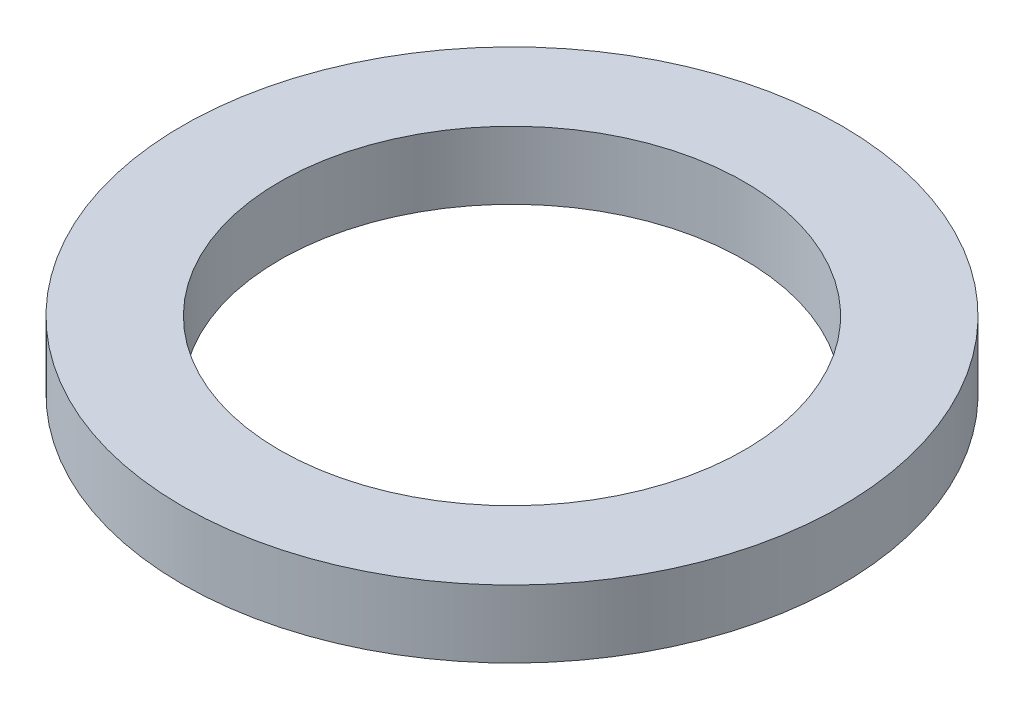
ISO-10303-21;
HEADER;
FILE_DESCRIPTION(('STEP AP214'),'2;1');
FILE_NAME('part.step','',(''),(''),'','','');
FILE_SCHEMA(('AUTOMOTIVE_DESIGN { 1 0 10303 214 1 1 1 1 }'));
ENDSEC;
DATA;
#1=APPLICATION_CONTEXT('core data for automotive mechanical design processes');
#2=APPLICATION_PROTOCOL_DEFINITION('international standard','automotive_design',2000,#1);
#3=PRODUCT_CONTEXT('',#1,'mechanical');
#4=PRODUCT('Part','Part','',(#3));
#5=PRODUCT_RELATED_PRODUCT_CATEGORY('part','',(#4));
#6=PRODUCT_DEFINITION_FORMATION('','',#4);
#7=PRODUCT_DEFINITION_CONTEXT('part definition',#1,'design');
#8=PRODUCT_DEFINITION('design','',#6,#7);
#9=PRODUCT_DEFINITION_SHAPE('','',#8);
#10=(LENGTH_UNIT() NAMED_UNIT(*) SI_UNIT(.MILLI.,.METRE.));
#11=(NAMED_UNIT(*) PLANE_ANGLE_UNIT() SI_UNIT($,.RADIAN.));
#12=(NAMED_UNIT(*) SI_UNIT($,.STERADIAN.) SOLID_ANGLE_UNIT());
#13=UNCERTAINTY_MEASURE_WITH_UNIT(LENGTH_MEASURE(1.E-05),#10,'distance_accuracy_value','');
#14=(GEOMETRIC_REPRESENTATION_CONTEXT(3) GLOBAL_UNCERTAINTY_ASSIGNED_CONTEXT((#13)) GLOBAL_UNIT_ASSIGNED_CONTEXT((#10,
#11,#12)) REPRESENTATION_CONTEXT('',''));
#15=CARTESIAN_POINT('',(0.,0.,0.));
#16=DIRECTION('',(0.,0.,1.));
#17=DIRECTION('',(1.,0.,0.));
#18=AXIS2_PLACEMENT_3D('',#15,#16,#17);
#19=CARTESIAN_POINT('',(0.,0.8,0.));
#20=DIRECTION('',(0.,-1.,0.));
#21=DIRECTION('',(0.,0.,-1.));
#22=AXIS2_PLACEMENT_3D('',#19,#20,#21);
#23=CYLINDRICAL_SURFACE('',#22,3.9);
#24=CARTESIAN_POINT('',(0.,0.8,0.));
#25=DIRECTION('',(0.,1.,0.));
#26=DIRECTION('',(0.,0.,1.));
#27=AXIS2_PLACEMENT_3D('',#24,#25,#26);
#28=CIRCLE('',#27,3.9);
#29=CARTESIAN_POINT('',(0.,0.8,3.9));
#30=VERTEX_POINT('',#29);
#31=EDGE_CURVE('E12',#30,#30,#28,.T.);
#32=ORIENTED_EDGE('',*,*,#31,.F.);
#33=EDGE_LOOP('',(#32));
#34=FACE_BOUND('',#33,.T.);
#35=CARTESIAN_POINT('',(0.,0.,0.));
#36=DIRECTION('',(0.,1.,0.));
#37=DIRECTION('',(0.,0.,1.));
#38=AXIS2_PLACEMENT_3D('',#35,#36,#37);
#39=CIRCLE('',#38,3.9);
#40=CARTESIAN_POINT('',(0.,0.,3.9));
#41=VERTEX_POINT('',#40);
#42=EDGE_CURVE('E50',#41,#41,#39,.T.);
#43=ORIENTED_EDGE('',*,*,#42,.T.);
#44=EDGE_LOOP('',(#43));
#45=FACE_BOUND('',#44,.T.);
#46=ADVANCED_FACE('F47',(#34,#45),#23,.T.);
#47=CARTESIAN_POINT('',(0.,0.8,0.));
#48=DIRECTION('',(0.,1.,0.));
#49=DIRECTION('',(0.,0.,1.));
#50=AXIS2_PLACEMENT_3D('',#47,#48,#49);
#51=PLANE('',#50);
#52=CARTESIAN_POINT('',(0.,0.8,0.));
#53=DIRECTION('',(0.,1.,0.));
#54=DIRECTION('',(0.,0.,1.));
#55=AXIS2_PLACEMENT_3D('',#52,#53,#54);
#56=CIRCLE('',#55,2.75);
#57=CARTESIAN_POINT('',(0.,0.8,2.75));
#58=VERTEX_POINT('',#57);
#59=EDGE_CURVE('E59',#58,#58,#56,.T.);
#60=ORIENTED_EDGE('',*,*,#59,.F.);
#61=EDGE_LOOP('',(#60));
#62=FACE_BOUND('',#61,.T.);
#63=ORIENTED_EDGE('',*,*,#31,.T.);
#64=EDGE_LOOP('',(#63));
#65=FACE_BOUND('',#64,.T.);
#66=ADVANCED_FACE('F74',(#62,#65),#51,.T.);
#67=CARTESIAN_POINT('',(0.,0.,0.));
#68=DIRECTION('',(0.,1.,0.));
#69=DIRECTION('',(0.,0.,1.));
#70=AXIS2_PLACEMENT_3D('',#67,#68,#69);
#71=PLANE('',#70);
#72=CARTESIAN_POINT('',(0.,0.,0.));
#73=DIRECTION('',(0.,1.,0.));
#74=DIRECTION('',(0.,0.,1.));
#75=AXIS2_PLACEMENT_3D('',#72,#73,#74);
#76=CIRCLE('',#75,2.75);
#77=CARTESIAN_POINT('',(0.,0.,2.75));
#78=VERTEX_POINT('',#77);
#79=EDGE_CURVE('E57',#78,#78,#76,.T.);
#80=ORIENTED_EDGE('',*,*,#79,.T.);
#81=EDGE_LOOP('',(#80));
#82=FACE_BOUND('',#81,.T.);
#83=ORIENTED_EDGE('',*,*,#42,.F.);
#84=EDGE_LOOP('',(#83));
#85=FACE_BOUND('',#84,.T.);
#86=ADVANCED_FACE('F65',(#82,#85),#71,.F.);
#87=CARTESIAN_POINT('',(0.,0.,0.));
#88=DIRECTION('',(0.,1.,0.));
#89=DIRECTION('',(0.,0.,1.));
#90=AXIS2_PLACEMENT_3D('',#87,#88,#89);
#91=CYLINDRICAL_SURFACE('',#90,2.75);
#92=ORIENTED_EDGE('',*,*,#79,.F.);
#93=EDGE_LOOP('',(#92));
#94=FACE_BOUND('',#93,.T.);
#95=ORIENTED_EDGE('',*,*,#59,.T.);
#96=EDGE_LOOP('',(#95));
#97=FACE_BOUND('',#96,.T.);
#98=ADVANCED_FACE('F68',(#94,#97),#91,.F.);
#99=CLOSED_SHELL('',(#46,#66,#86,#98));
#100=MANIFOLD_SOLID_BREP('B2',#99);
#101=ADVANCED_BREP_SHAPE_REPRESENTATION('',(#18,#100),#14);
#102=SHAPE_DEFINITION_REPRESENTATION(#9,#101);
ENDSEC;
END-ISO-10303-21;
